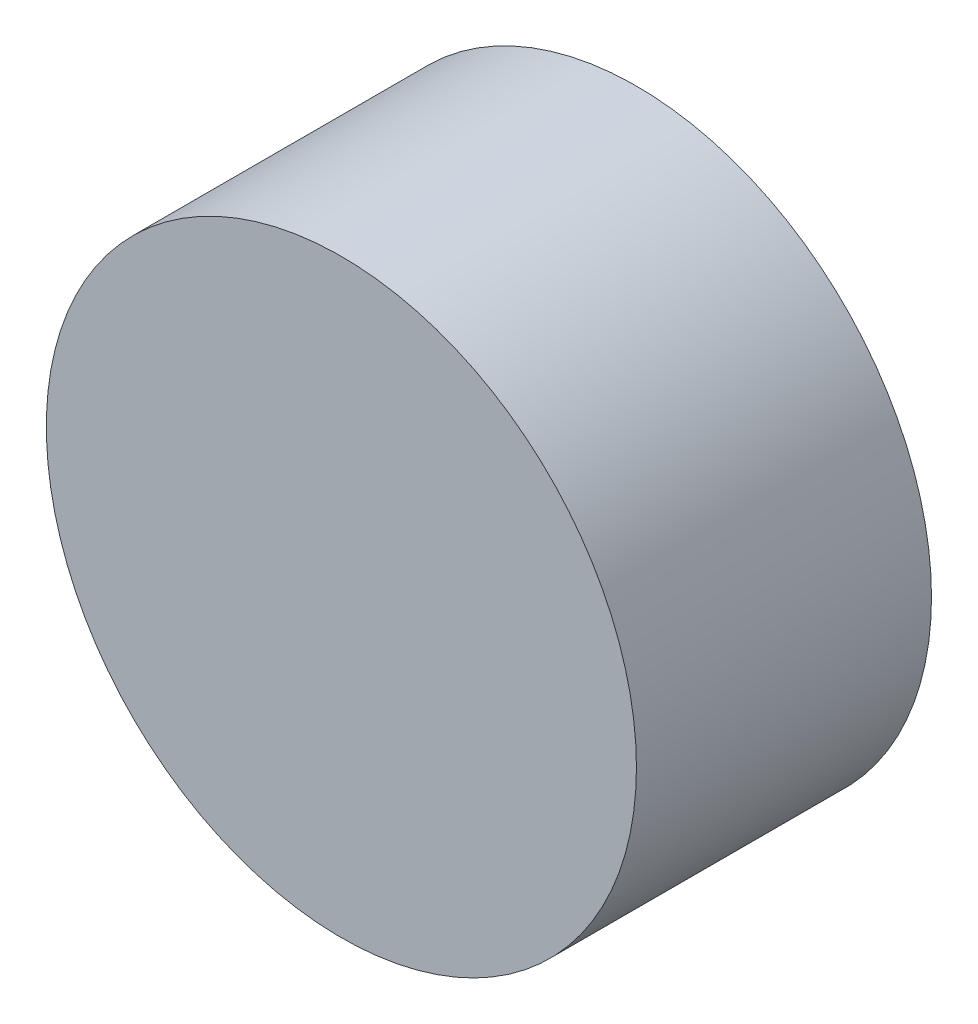
ISO-10303-21;
HEADER;
FILE_DESCRIPTION(('STEP AP214'),'2;1');
FILE_NAME('part.step','',(''),(''),'','','');
FILE_SCHEMA(('AUTOMOTIVE_DESIGN { 1 0 10303 214 1 1 1 1 }'));
ENDSEC;
DATA;
#1=APPLICATION_CONTEXT('core data for automotive mechanical design processes');
#2=APPLICATION_PROTOCOL_DEFINITION('international standard','automotive_design',2000,#1);
#3=PRODUCT_CONTEXT('',#1,'mechanical');
#4=PRODUCT('Part','Part','',(#3));
#5=PRODUCT_RELATED_PRODUCT_CATEGORY('part','',(#4));
#6=PRODUCT_DEFINITION_FORMATION('','',#4);
#7=PRODUCT_DEFINITION_CONTEXT('part definition',#1,'design');
#8=PRODUCT_DEFINITION('design','',#6,#7);
#9=PRODUCT_DEFINITION_SHAPE('','',#8);
#10=(LENGTH_UNIT() NAMED_UNIT(*) SI_UNIT(.MILLI.,.METRE.));
#11=(NAMED_UNIT(*) PLANE_ANGLE_UNIT() SI_UNIT($,.RADIAN.));
#12=(NAMED_UNIT(*) SI_UNIT($,.STERADIAN.) SOLID_ANGLE_UNIT());
#13=UNCERTAINTY_MEASURE_WITH_UNIT(LENGTH_MEASURE(1.E-05),#10,'distance_accuracy_value','');
#14=(GEOMETRIC_REPRESENTATION_CONTEXT(3) GLOBAL_UNCERTAINTY_ASSIGNED_CONTEXT((#13)) GLOBAL_UNIT_ASSIGNED_CONTEXT((#10,
#11,#12)) REPRESENTATION_CONTEXT('',''));
#15=CARTESIAN_POINT('',(0.,0.,0.));
#16=DIRECTION('',(0.,0.,1.));
#17=DIRECTION('',(1.,0.,0.));
#18=AXIS2_PLACEMENT_3D('',#15,#16,#17);
#19=CARTESIAN_POINT('',(0.,0.,20.));
#20=DIRECTION('',(0.,0.,-1.));
#21=DIRECTION('',(-1.,0.,0.));
#22=AXIS2_PLACEMENT_3D('',#19,#20,#21);
#23=CYLINDRICAL_SURFACE('',#22,20.);
#24=CARTESIAN_POINT('',(0.,0.,20.));
#25=DIRECTION('',(0.,0.,1.));
#26=DIRECTION('',(1.,0.,0.));
#27=AXIS2_PLACEMENT_3D('',#24,#25,#26);
#28=CIRCLE('',#27,20.);
#29=CARTESIAN_POINT('',(20.,0.,20.));
#30=VERTEX_POINT('',#29);
#31=EDGE_CURVE('E10',#30,#30,#28,.T.);
#32=ORIENTED_EDGE('',*,*,#31,.F.);
#33=EDGE_LOOP('',(#32));
#34=FACE_BOUND('',#33,.T.);
#35=CARTESIAN_POINT('',(0.,0.,0.));
#36=DIRECTION('',(0.,0.,1.));
#37=DIRECTION('',(1.,0.,0.));
#38=AXIS2_PLACEMENT_3D('',#35,#36,#37);
#39=CIRCLE('',#38,20.);
#40=CARTESIAN_POINT('',(20.,0.,0.));
#41=VERTEX_POINT('',#40);
#42=EDGE_CURVE('E34',#41,#41,#39,.T.);
#43=ORIENTED_EDGE('',*,*,#42,.T.);
#44=EDGE_LOOP('',(#43));
#45=FACE_BOUND('',#44,.T.);
#46=ADVANCED_FACE('F31',(#34,#45),#23,.T.);
#47=CARTESIAN_POINT('',(0.,0.,20.));
#48=DIRECTION('',(0.,0.,1.));
#49=DIRECTION('',(1.,0.,0.));
#50=AXIS2_PLACEMENT_3D('',#47,#48,#49);
#51=PLANE('',#50);
#52=ORIENTED_EDGE('',*,*,#31,.T.);
#53=EDGE_LOOP('',(#52));
#54=FACE_BOUND('',#53,.T.);
#55=ADVANCED_FACE('F46',(#54),#51,.T.);
#56=CARTESIAN_POINT('',(0.,0.,0.));
#57=DIRECTION('',(0.,0.,1.));
#58=DIRECTION('',(1.,0.,0.));
#59=AXIS2_PLACEMENT_3D('',#56,#57,#58);
#60=PLANE('',#59);
#61=ORIENTED_EDGE('',*,*,#42,.F.);
#62=EDGE_LOOP('',(#61));
#63=FACE_BOUND('',#62,.T.);
#64=ADVANCED_FACE('F44',(#63),#60,.F.);
#65=CLOSED_SHELL('',(#46,#55,#64));
#66=MANIFOLD_SOLID_BREP('B2',#65);
#67=ADVANCED_BREP_SHAPE_REPRESENTATION('',(#18,#66),#14);
#68=SHAPE_DEFINITION_REPRESENTATION(#9,#67);
ENDSEC;
END-ISO-10303-21;
